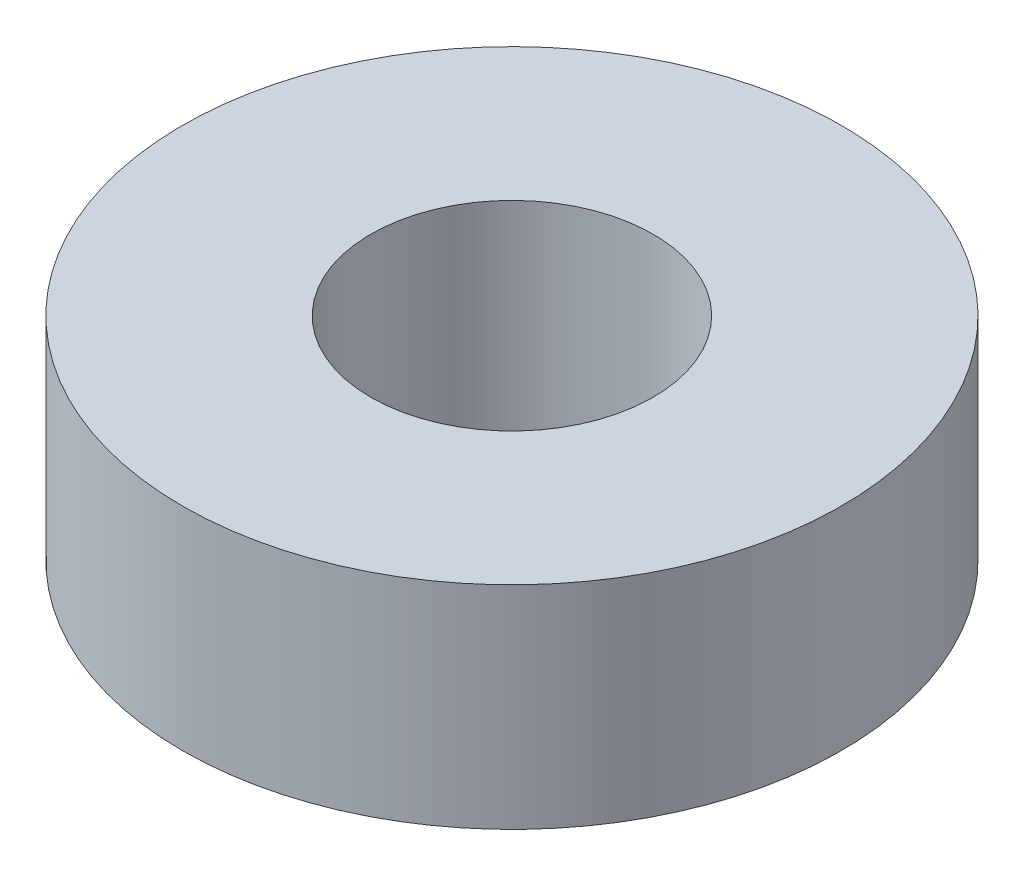
ISO-10303-21;
HEADER;
FILE_DESCRIPTION(('STEP AP214'),'2;1');
FILE_NAME('part.step','',(''),(''),'','','');
FILE_SCHEMA(('AUTOMOTIVE_DESIGN { 1 0 10303 214 1 1 1 1 }'));
ENDSEC;
DATA;
#1=APPLICATION_CONTEXT('core data for automotive mechanical design processes');
#2=APPLICATION_PROTOCOL_DEFINITION('international standard','automotive_design',2000,#1);
#3=PRODUCT_CONTEXT('',#1,'mechanical');
#4=PRODUCT('Part','Part','',(#3));
#5=PRODUCT_RELATED_PRODUCT_CATEGORY('part','',(#4));
#6=PRODUCT_DEFINITION_FORMATION('','',#4);
#7=PRODUCT_DEFINITION_CONTEXT('part definition',#1,'design');
#8=PRODUCT_DEFINITION('design','',#6,#7);
#9=PRODUCT_DEFINITION_SHAPE('','',#8);
#10=(LENGTH_UNIT() NAMED_UNIT(*) SI_UNIT(.MILLI.,.METRE.));
#11=(NAMED_UNIT(*) PLANE_ANGLE_UNIT() SI_UNIT($,.RADIAN.));
#12=(NAMED_UNIT(*) SI_UNIT($,.STERADIAN.) SOLID_ANGLE_UNIT());
#13=UNCERTAINTY_MEASURE_WITH_UNIT(LENGTH_MEASURE(1.E-05),#10,'distance_accuracy_value','');
#14=(GEOMETRIC_REPRESENTATION_CONTEXT(3) GLOBAL_UNCERTAINTY_ASSIGNED_CONTEXT((#13)) GLOBAL_UNIT_ASSIGNED_CONTEXT((#10,
#11,#12)) REPRESENTATION_CONTEXT('',''));
#15=CARTESIAN_POINT('',(0.,0.,0.));
#16=DIRECTION('',(0.,0.,1.));
#17=DIRECTION('',(1.,0.,0.));
#18=AXIS2_PLACEMENT_3D('',#15,#16,#17);
#19=CARTESIAN_POINT('',(0.,3.571875,0.));
#20=DIRECTION('',(0.,1.,0.));
#21=DIRECTION('',(0.,0.,1.));
#22=AXIS2_PLACEMENT_3D('',#19,#20,#21);
#23=PLANE('',#22);
#24=CARTESIAN_POINT('',(0.,3.571875,0.));
#25=DIRECTION('',(0.,1.,0.));
#26=DIRECTION('',(0.,0.,1.));
#27=AXIS2_PLACEMENT_3D('',#24,#25,#26);
#28=CIRCLE('',#27,11.1125);
#29=CARTESIAN_POINT('',(0.,3.571875,11.1125));
#30=VERTEX_POINT('',#29);
#31=EDGE_CURVE('E10',#30,#30,#28,.T.);
#32=ORIENTED_EDGE('',*,*,#31,.T.);
#33=EDGE_LOOP('',(#32));
#34=FACE_BOUND('',#33,.T.);
#35=CARTESIAN_POINT('',(0.,3.571875,0.));
#36=DIRECTION('',(0.,1.,0.));
#37=DIRECTION('',(0.,0.,1.));
#38=AXIS2_PLACEMENT_3D('',#35,#36,#37);
#39=CIRCLE('',#38,4.7625);
#40=CARTESIAN_POINT('',(0.,3.571875,4.7625));
#41=VERTEX_POINT('',#40);
#42=EDGE_CURVE('E39',#41,#41,#39,.T.);
#43=ORIENTED_EDGE('',*,*,#42,.F.);
#44=EDGE_LOOP('',(#43));
#45=FACE_BOUND('',#44,.T.);
#46=ADVANCED_FACE('F28',(#34,#45),#23,.T.);
#47=CARTESIAN_POINT('',(0.,-3.571875,0.));
#48=DIRECTION('',(0.,1.,0.));
#49=DIRECTION('',(0.,0.,1.));
#50=AXIS2_PLACEMENT_3D('',#47,#48,#49);
#51=PLANE('',#50);
#52=CARTESIAN_POINT('',(0.,-3.571875,0.));
#53=DIRECTION('',(0.,1.,0.));
#54=DIRECTION('',(0.,0.,1.));
#55=AXIS2_PLACEMENT_3D('',#52,#53,#54);
#56=CIRCLE('',#55,11.1125);
#57=CARTESIAN_POINT('',(0.,-3.571875,11.1125));
#58=VERTEX_POINT('',#57);
#59=EDGE_CURVE('E32',#58,#58,#56,.T.);
#60=ORIENTED_EDGE('',*,*,#59,.F.);
#61=EDGE_LOOP('',(#60));
#62=FACE_BOUND('',#61,.T.);
#63=CARTESIAN_POINT('',(0.,-3.571875,0.));
#64=DIRECTION('',(0.,1.,0.));
#65=DIRECTION('',(0.,0.,1.));
#66=AXIS2_PLACEMENT_3D('',#63,#64,#65);
#67=CIRCLE('',#66,4.7625);
#68=CARTESIAN_POINT('',(0.,-3.571875,4.7625));
#69=VERTEX_POINT('',#68);
#70=EDGE_CURVE('E41',#69,#69,#67,.T.);
#71=ORIENTED_EDGE('',*,*,#70,.T.);
#72=EDGE_LOOP('',(#71));
#73=FACE_BOUND('',#72,.T.);
#74=ADVANCED_FACE('F51',(#62,#73),#51,.F.);
#75=CARTESIAN_POINT('',(0.,3.571875,0.));
#76=DIRECTION('',(0.,-1.,0.));
#77=DIRECTION('',(0.,0.,-1.));
#78=AXIS2_PLACEMENT_3D('',#75,#76,#77);
#79=CYLINDRICAL_SURFACE('',#78,11.1125);
#80=ORIENTED_EDGE('',*,*,#31,.F.);
#81=EDGE_LOOP('',(#80));
#82=FACE_BOUND('',#81,.T.);
#83=ORIENTED_EDGE('',*,*,#59,.T.);
#84=EDGE_LOOP('',(#83));
#85=FACE_BOUND('',#84,.T.);
#86=ADVANCED_FACE('F30',(#82,#85),#79,.T.);
#87=CARTESIAN_POINT('',(0.,3.571875,0.));
#88=DIRECTION('',(0.,-1.,0.));
#89=DIRECTION('',(0.,0.,-1.));
#90=AXIS2_PLACEMENT_3D('',#87,#88,#89);
#91=CYLINDRICAL_SURFACE('',#90,4.7625);
#92=ORIENTED_EDGE('',*,*,#42,.T.);
#93=EDGE_LOOP('',(#92));
#94=FACE_BOUND('',#93,.T.);
#95=ORIENTED_EDGE('',*,*,#70,.F.);
#96=EDGE_LOOP('',(#95));
#97=FACE_BOUND('',#96,.T.);
#98=ADVANCED_FACE('F47',(#94,#97),#91,.F.);
#99=CLOSED_SHELL('',(#46,#74,#86,#98));
#100=MANIFOLD_SOLID_BREP('B2',#99);
#101=ADVANCED_BREP_SHAPE_REPRESENTATION('',(#18,#100),#14);
#102=SHAPE_DEFINITION_REPRESENTATION(#9,#101);
ENDSEC;
END-ISO-10303-21;
